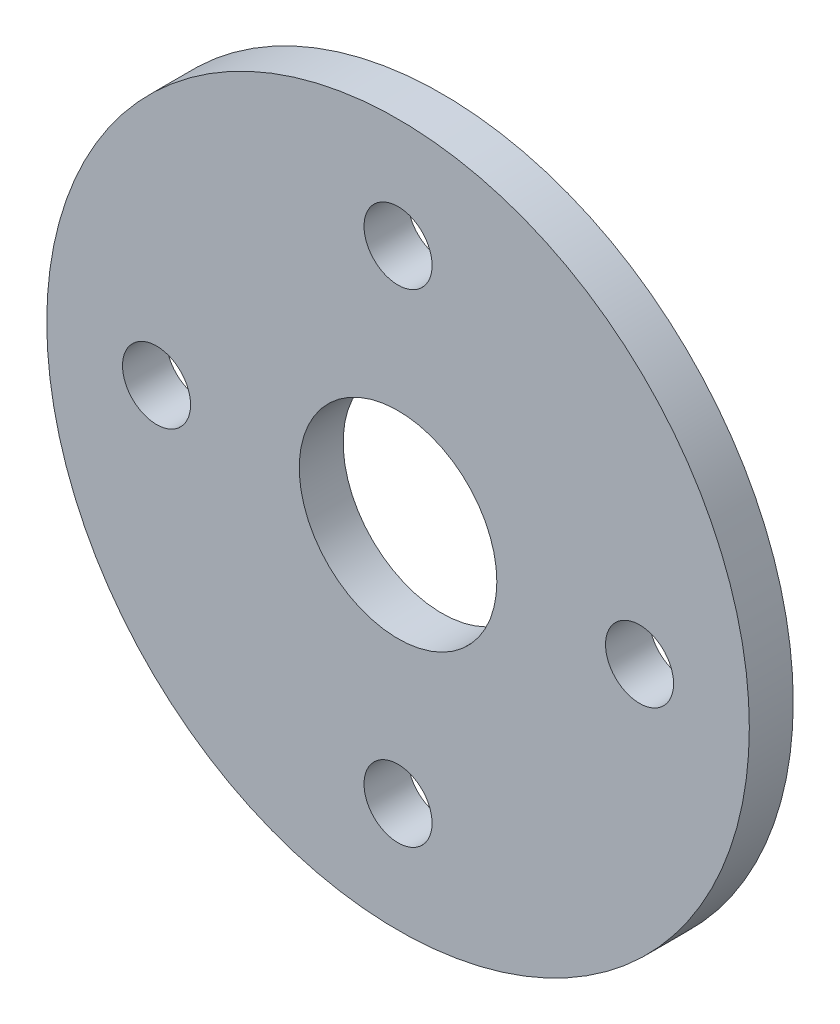
ISO-10303-21;
HEADER;
FILE_DESCRIPTION(('STEP AP214'),'2;1');
FILE_NAME('part.step','',(''),(''),'','','');
FILE_SCHEMA(('AUTOMOTIVE_DESIGN { 1 0 10303 214 1 1 1 1 }'));
ENDSEC;
DATA;
#1=APPLICATION_CONTEXT('core data for automotive mechanical design processes');
#2=APPLICATION_PROTOCOL_DEFINITION('international standard','automotive_design',2000,#1);
#3=PRODUCT_CONTEXT('',#1,'mechanical');
#4=PRODUCT('Part','Part','',(#3));
#5=PRODUCT_RELATED_PRODUCT_CATEGORY('part','',(#4));
#6=PRODUCT_DEFINITION_FORMATION('','',#4);
#7=PRODUCT_DEFINITION_CONTEXT('part definition',#1,'design');
#8=PRODUCT_DEFINITION('design','',#6,#7);
#9=PRODUCT_DEFINITION_SHAPE('','',#8);
#10=(LENGTH_UNIT() NAMED_UNIT(*) SI_UNIT(.MILLI.,.METRE.));
#11=(NAMED_UNIT(*) PLANE_ANGLE_UNIT() SI_UNIT($,.RADIAN.));
#12=(NAMED_UNIT(*) SI_UNIT($,.STERADIAN.) SOLID_ANGLE_UNIT());
#13=UNCERTAINTY_MEASURE_WITH_UNIT(LENGTH_MEASURE(1.E-05),#10,'distance_accuracy_value','');
#14=(GEOMETRIC_REPRESENTATION_CONTEXT(3) GLOBAL_UNCERTAINTY_ASSIGNED_CONTEXT((#13)) GLOBAL_UNIT_ASSIGNED_CONTEXT((#10,
#11,#12)) REPRESENTATION_CONTEXT('',''));
#15=CARTESIAN_POINT('',(0.,0.,0.));
#16=DIRECTION('',(0.,0.,1.));
#17=DIRECTION('',(1.,0.,0.));
#18=AXIS2_PLACEMENT_3D('',#15,#16,#17);
#19=CARTESIAN_POINT('',(0.,0.,2.));
#20=DIRECTION('',(0.,0.,1.));
#21=DIRECTION('',(1.,0.,0.));
#22=AXIS2_PLACEMENT_3D('',#19,#20,#21);
#23=PLANE('',#22);
#24=CARTESIAN_POINT('',(4.52175592608255E-13,-11.,2.));
#25=DIRECTION('',(0.,0.,1.));
#26=DIRECTION('',(1.,0.,0.));
#27=AXIS2_PLACEMENT_3D('',#24,#25,#26);
#28=CIRCLE('',#27,1.55);
#29=CARTESIAN_POINT('',(1.55000000000045,-11.,2.));
#30=VERTEX_POINT('',#29);
#31=EDGE_CURVE('E65',#30,#30,#28,.T.);
#32=ORIENTED_EDGE('',*,*,#31,.F.);
#33=EDGE_LOOP('',(#32));
#34=FACE_BOUND('',#33,.T.);
#35=CARTESIAN_POINT('',(0.,11.,2.));
#36=DIRECTION('',(0.,0.,1.));
#37=DIRECTION('',(1.,0.,0.));
#38=AXIS2_PLACEMENT_3D('',#35,#36,#37);
#39=CIRCLE('',#38,1.55);
#40=CARTESIAN_POINT('',(1.55,11.,2.));
#41=VERTEX_POINT('',#40);
#42=EDGE_CURVE('E53',#41,#41,#39,.T.);
#43=ORIENTED_EDGE('',*,*,#42,.F.);
#44=EDGE_LOOP('',(#43));
#45=FACE_BOUND('',#44,.T.);
#46=CARTESIAN_POINT('',(0.,0.,2.));
#47=DIRECTION('',(0.,0.,1.));
#48=DIRECTION('',(1.,0.,0.));
#49=AXIS2_PLACEMENT_3D('',#46,#47,#48);
#50=CIRCLE('',#49,16.);
#51=CARTESIAN_POINT('',(16.,0.,2.));
#52=VERTEX_POINT('',#51);
#53=EDGE_CURVE('E10',#52,#52,#50,.T.);
#54=ORIENTED_EDGE('',*,*,#53,.T.);
#55=EDGE_LOOP('',(#54));
#56=FACE_BOUND('',#55,.T.);
#57=CARTESIAN_POINT('',(0.,0.,2.));
#58=DIRECTION('',(0.,0.,1.));
#59=DIRECTION('',(1.,0.,0.));
#60=AXIS2_PLACEMENT_3D('',#57,#58,#59);
#61=CIRCLE('',#60,4.5);
#62=CARTESIAN_POINT('',(4.5,0.,2.));
#63=VERTEX_POINT('',#62);
#64=EDGE_CURVE('E48',#63,#63,#61,.T.);
#65=ORIENTED_EDGE('',*,*,#64,.F.);
#66=EDGE_LOOP('',(#65));
#67=FACE_BOUND('',#66,.T.);
#68=CARTESIAN_POINT('',(11.0000000000002,2.26087796304127E-13,2.));
#69=DIRECTION('',(0.,0.,1.));
#70=DIRECTION('',(1.,0.,0.));
#71=AXIS2_PLACEMENT_3D('',#68,#69,#70);
#72=CIRCLE('',#71,1.55);
#73=CARTESIAN_POINT('',(12.5500000000002,2.26087796304127E-13,2.));
#74=VERTEX_POINT('',#73);
#75=EDGE_CURVE('E59',#74,#74,#72,.T.);
#76=ORIENTED_EDGE('',*,*,#75,.F.);
#77=EDGE_LOOP('',(#76));
#78=FACE_BOUND('',#77,.T.);
#79=CARTESIAN_POINT('',(-10.9999999999998,-2.27434907783189E-13,2.));
#80=DIRECTION('',(0.,0.,1.));
#81=DIRECTION('',(1.,0.,0.));
#82=AXIS2_PLACEMENT_3D('',#79,#80,#81);
#83=CIRCLE('',#82,1.55);
#84=CARTESIAN_POINT('',(-9.44999999999977,-2.27434907783189E-13,2.));
#85=VERTEX_POINT('',#84);
#86=EDGE_CURVE('E71',#85,#85,#83,.T.);
#87=ORIENTED_EDGE('',*,*,#86,.F.);
#88=EDGE_LOOP('',(#87));
#89=FACE_BOUND('',#88,.T.);
#90=ADVANCED_FACE('F37',(#34,#45,#56,#67,#78,#89),#23,.T.);
#91=CARTESIAN_POINT('',(0.,0.,0.));
#92=DIRECTION('',(0.,0.,1.));
#93=DIRECTION('',(1.,0.,0.));
#94=AXIS2_PLACEMENT_3D('',#91,#92,#93);
#95=PLANE('',#94);
#96=CARTESIAN_POINT('',(0.,0.,0.));
#97=DIRECTION('',(0.,0.,1.));
#98=DIRECTION('',(1.,0.,0.));
#99=AXIS2_PLACEMENT_3D('',#96,#97,#98);
#100=CIRCLE('',#99,16.);
#101=CARTESIAN_POINT('',(16.,0.,0.));
#102=VERTEX_POINT('',#101);
#103=EDGE_CURVE('E41',#102,#102,#100,.T.);
#104=ORIENTED_EDGE('',*,*,#103,.F.);
#105=EDGE_LOOP('',(#104));
#106=FACE_BOUND('',#105,.T.);
#107=CARTESIAN_POINT('',(0.,0.,0.));
#108=DIRECTION('',(0.,0.,1.));
#109=DIRECTION('',(1.,0.,0.));
#110=AXIS2_PLACEMENT_3D('',#107,#108,#109);
#111=CIRCLE('',#110,4.5);
#112=CARTESIAN_POINT('',(4.5,0.,0.));
#113=VERTEX_POINT('',#112);
#114=EDGE_CURVE('E50',#113,#113,#111,.T.);
#115=ORIENTED_EDGE('',*,*,#114,.T.);
#116=EDGE_LOOP('',(#115));
#117=FACE_BOUND('',#116,.T.);
#118=CARTESIAN_POINT('',(0.,11.,0.));
#119=DIRECTION('',(0.,0.,1.));
#120=DIRECTION('',(1.,0.,0.));
#121=AXIS2_PLACEMENT_3D('',#118,#119,#120);
#122=CIRCLE('',#121,1.55);
#123=CARTESIAN_POINT('',(1.55,11.,0.));
#124=VERTEX_POINT('',#123);
#125=EDGE_CURVE('E56',#124,#124,#122,.T.);
#126=ORIENTED_EDGE('',*,*,#125,.T.);
#127=EDGE_LOOP('',(#126));
#128=FACE_BOUND('',#127,.T.);
#129=CARTESIAN_POINT('',(11.0000000000002,2.26087796304127E-13,0.));
#130=DIRECTION('',(0.,0.,1.));
#131=DIRECTION('',(1.,0.,0.));
#132=AXIS2_PLACEMENT_3D('',#129,#130,#131);
#133=CIRCLE('',#132,1.55);
#134=CARTESIAN_POINT('',(12.5500000000002,2.26087796304127E-13,0.));
#135=VERTEX_POINT('',#134);
#136=EDGE_CURVE('E62',#135,#135,#133,.T.);
#137=ORIENTED_EDGE('',*,*,#136,.T.);
#138=EDGE_LOOP('',(#137));
#139=FACE_BOUND('',#138,.T.);
#140=CARTESIAN_POINT('',(4.52175592608255E-13,-11.,0.));
#141=DIRECTION('',(0.,0.,1.));
#142=DIRECTION('',(1.,0.,0.));
#143=AXIS2_PLACEMENT_3D('',#140,#141,#142);
#144=CIRCLE('',#143,1.55);
#145=CARTESIAN_POINT('',(1.55000000000045,-11.,0.));
#146=VERTEX_POINT('',#145);
#147=EDGE_CURVE('E68',#146,#146,#144,.T.);
#148=ORIENTED_EDGE('',*,*,#147,.T.);
#149=EDGE_LOOP('',(#148));
#150=FACE_BOUND('',#149,.T.);
#151=CARTESIAN_POINT('',(-10.9999999999998,-2.27434907783189E-13,0.));
#152=DIRECTION('',(0.,0.,1.));
#153=DIRECTION('',(1.,0.,0.));
#154=AXIS2_PLACEMENT_3D('',#151,#152,#153);
#155=CIRCLE('',#154,1.55);
#156=CARTESIAN_POINT('',(-9.44999999999977,-2.27434907783189E-13,0.));
#157=VERTEX_POINT('',#156);
#158=EDGE_CURVE('E74',#157,#157,#155,.T.);
#159=ORIENTED_EDGE('',*,*,#158,.T.);
#160=EDGE_LOOP('',(#159));
#161=FACE_BOUND('',#160,.T.);
#162=ADVANCED_FACE('F84',(#106,#117,#128,#139,#150,#161),#95,.F.);
#163=CARTESIAN_POINT('',(0.,0.,2.));
#164=DIRECTION('',(0.,0.,-1.));
#165=DIRECTION('',(-1.,0.,0.));
#166=AXIS2_PLACEMENT_3D('',#163,#164,#165);
#167=CYLINDRICAL_SURFACE('',#166,16.);
#168=ORIENTED_EDGE('',*,*,#53,.F.);
#169=EDGE_LOOP('',(#168));
#170=FACE_BOUND('',#169,.T.);
#171=ORIENTED_EDGE('',*,*,#103,.T.);
#172=EDGE_LOOP('',(#171));
#173=FACE_BOUND('',#172,.T.);
#174=ADVANCED_FACE('F39',(#170,#173),#167,.T.);
#175=CARTESIAN_POINT('',(0.,0.,2.));
#176=DIRECTION('',(0.,0.,-1.));
#177=DIRECTION('',(-1.,0.,0.));
#178=AXIS2_PLACEMENT_3D('',#175,#176,#177);
#179=CYLINDRICAL_SURFACE('',#178,4.5);
#180=ORIENTED_EDGE('',*,*,#64,.T.);
#181=EDGE_LOOP('',(#180));
#182=FACE_BOUND('',#181,.T.);
#183=ORIENTED_EDGE('',*,*,#114,.F.);
#184=EDGE_LOOP('',(#183));
#185=FACE_BOUND('',#184,.T.);
#186=ADVANCED_FACE('F94',(#182,#185),#179,.F.);
#187=CARTESIAN_POINT('',(0.,11.,2.));
#188=DIRECTION('',(0.,0.,-1.));
#189=DIRECTION('',(-1.,0.,0.));
#190=AXIS2_PLACEMENT_3D('',#187,#188,#189);
#191=CYLINDRICAL_SURFACE('',#190,1.55);
#192=ORIENTED_EDGE('',*,*,#42,.T.);
#193=EDGE_LOOP('',(#192));
#194=FACE_BOUND('',#193,.T.);
#195=ORIENTED_EDGE('',*,*,#125,.F.);
#196=EDGE_LOOP('',(#195));
#197=FACE_BOUND('',#196,.T.);
#198=ADVANCED_FACE('F97',(#194,#197),#191,.F.);
#199=CARTESIAN_POINT('',(11.0000000000002,2.26087796304127E-13,2.));
#200=DIRECTION('',(0.,0.,-1.));
#201=DIRECTION('',(-1.,0.,0.));
#202=AXIS2_PLACEMENT_3D('',#199,#200,#201);
#203=CYLINDRICAL_SURFACE('',#202,1.55);
#204=ORIENTED_EDGE('',*,*,#75,.T.);
#205=EDGE_LOOP('',(#204));
#206=FACE_BOUND('',#205,.T.);
#207=ORIENTED_EDGE('',*,*,#136,.F.);
#208=EDGE_LOOP('',(#207));
#209=FACE_BOUND('',#208,.T.);
#210=ADVANCED_FACE('F101',(#206,#209),#203,.F.);
#211=CARTESIAN_POINT('',(4.52175592608255E-13,-11.,2.));
#212=DIRECTION('',(0.,0.,-1.));
#213=DIRECTION('',(-1.,0.,0.));
#214=AXIS2_PLACEMENT_3D('',#211,#212,#213);
#215=CYLINDRICAL_SURFACE('',#214,1.55);
#216=ORIENTED_EDGE('',*,*,#31,.T.);
#217=EDGE_LOOP('',(#216));
#218=FACE_BOUND('',#217,.T.);
#219=ORIENTED_EDGE('',*,*,#147,.F.);
#220=EDGE_LOOP('',(#219));
#221=FACE_BOUND('',#220,.T.);
#222=ADVANCED_FACE('F105',(#218,#221),#215,.F.);
#223=CARTESIAN_POINT('',(-10.9999999999998,-2.27434907783189E-13,2.));
#224=DIRECTION('',(0.,0.,-1.));
#225=DIRECTION('',(-1.,0.,0.));
#226=AXIS2_PLACEMENT_3D('',#223,#224,#225);
#227=CYLINDRICAL_SURFACE('',#226,1.55);
#228=ORIENTED_EDGE('',*,*,#86,.T.);
#229=EDGE_LOOP('',(#228));
#230=FACE_BOUND('',#229,.T.);
#231=ORIENTED_EDGE('',*,*,#158,.F.);
#232=EDGE_LOOP('',(#231));
#233=FACE_BOUND('',#232,.T.);
#234=ADVANCED_FACE('F80',(#230,#233),#227,.F.);
#235=CLOSED_SHELL('',(#90,#162,#174,#186,#198,#210,#222,#234));
#236=MANIFOLD_SOLID_BREP('B2',#235);
#237=ADVANCED_BREP_SHAPE_REPRESENTATION('',(#18,#236),#14);
#238=SHAPE_DEFINITION_REPRESENTATION(#9,#237);
ENDSEC;
END-ISO-10303-21;
